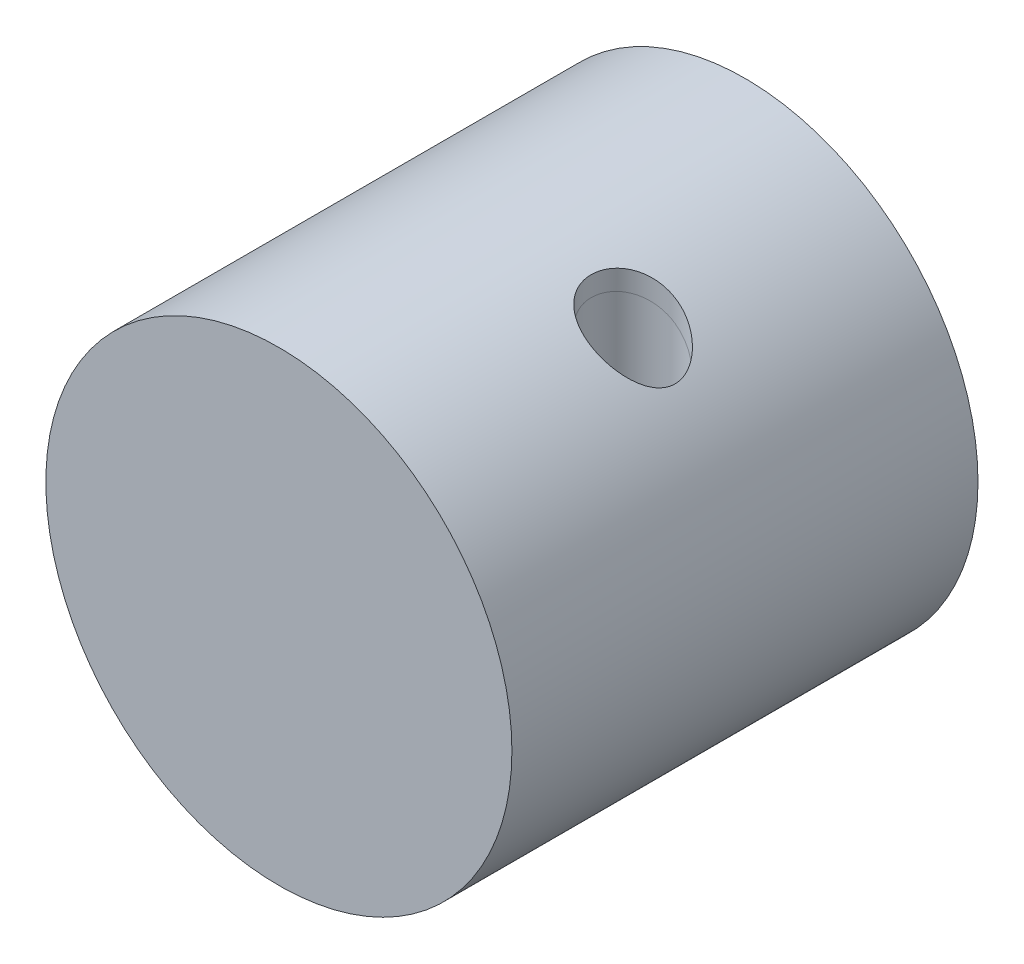
ISO-10303-21;
HEADER;
FILE_DESCRIPTION(('STEP AP214'),'2;1');
FILE_NAME('part.step','',(''),(''),'','','');
FILE_SCHEMA(('AUTOMOTIVE_DESIGN { 1 0 10303 214 1 1 1 1 }'));
ENDSEC;
DATA;
#1=APPLICATION_CONTEXT('core data for automotive mechanical design processes');
#2=APPLICATION_PROTOCOL_DEFINITION('international standard','automotive_design',2000,#1);
#3=PRODUCT_CONTEXT('',#1,'mechanical');
#4=PRODUCT('Part','Part','',(#3));
#5=PRODUCT_RELATED_PRODUCT_CATEGORY('part','',(#4));
#6=PRODUCT_DEFINITION_FORMATION('','',#4);
#7=PRODUCT_DEFINITION_CONTEXT('part definition',#1,'design');
#8=PRODUCT_DEFINITION('design','',#6,#7);
#9=PRODUCT_DEFINITION_SHAPE('','',#8);
#10=(LENGTH_UNIT() NAMED_UNIT(*) SI_UNIT(.MILLI.,.METRE.));
#11=(NAMED_UNIT(*) PLANE_ANGLE_UNIT() SI_UNIT($,.RADIAN.));
#12=(NAMED_UNIT(*) SI_UNIT($,.STERADIAN.) SOLID_ANGLE_UNIT());
#13=UNCERTAINTY_MEASURE_WITH_UNIT(LENGTH_MEASURE(1.E-05),#10,'distance_accuracy_value','');
#14=(GEOMETRIC_REPRESENTATION_CONTEXT(3) GLOBAL_UNCERTAINTY_ASSIGNED_CONTEXT((#13)) GLOBAL_UNIT_ASSIGNED_CONTEXT((#10,
#11,#12)) REPRESENTATION_CONTEXT('',''));
#15=CARTESIAN_POINT('',(0.,0.,0.));
#16=DIRECTION('',(0.,0.,1.));
#17=DIRECTION('',(1.,0.,0.));
#18=AXIS2_PLACEMENT_3D('',#15,#16,#17);
#19=CARTESIAN_POINT('',(13.,50.,0.));
#20=DIRECTION('',(0.,-1.,0.));
#21=DIRECTION('',(0.,0.,-1.));
#22=AXIS2_PLACEMENT_3D('',#19,#20,#21);
#23=CYLINDRICAL_SURFACE('',#22,4.5);
#24=CARTESIAN_POINT('',(13.,21.3541565040626,-4.5));
#25=CARTESIAN_POINT('',(12.8683083991912,21.4343283065168,-4.50000021130359));
#26=CARTESIAN_POINT('',(12.7358798462921,21.5132750834874,-4.49421928114834));
#27=CARTESIAN_POINT('',(12.4703872059696,21.668249916151,-4.47071172861597));
#28=CARTESIAN_POINT('',(12.3373232338289,21.7442784802387,-4.45298719706191));
#29=CARTESIAN_POINT('',(12.0715049528344,21.8929660083225,-4.40523905144603));
#30=CARTESIAN_POINT('',(11.9387506473561,21.9656249357485,-4.37521530393735));
#31=CARTESIAN_POINT('',(11.6747002993951,22.1070983110776,-4.30259453622405));
#32=CARTESIAN_POINT('',(11.5434036630383,22.1759143743938,-4.26000284720951));
#33=CARTESIAN_POINT('',(11.282555931864,22.3097638774261,-4.16172312507943));
#34=CARTESIAN_POINT('',(11.1530225331364,22.3747687408069,-4.10594887628823));
#35=CARTESIAN_POINT('',(10.898039963101,22.5000643262043,-3.98144208737061));
#36=CARTESIAN_POINT('',(10.772588838697,22.5603573224791,-3.91271585406112));
#37=CARTESIAN_POINT('',(10.5271854998054,22.6759070361995,-3.76243096744329));
#38=CARTESIAN_POINT('',(10.4072325009245,22.7311644731645,-3.68087415202204));
#39=CARTESIAN_POINT('',(10.1743410402409,22.8363549959848,-3.50526909122277));
#40=CARTESIAN_POINT('',(10.061401611596,22.8862888164002,-3.41122257322354));
#41=CARTESIAN_POINT('',(9.85624898068404,22.975322232402,-3.22242632233634));
#42=CARTESIAN_POINT('',(9.76313099014731,23.015008903793,-3.1289342918651));
#43=CARTESIAN_POINT('',(9.58469637270071,23.0898886271902,-2.93312799805031));
#44=CARTESIAN_POINT('',(9.49937882892767,23.1250822075068,-2.83081477430216));
#45=CARTESIAN_POINT('',(9.33758184077166,23.1908860186382,-2.61811792437517));
#46=CARTESIAN_POINT('',(9.26109867799038,23.2214981793923,-2.50773772576853));
#47=CARTESIAN_POINT('',(9.11786163311945,23.2781127639742,-2.27972026996115));
#48=CARTESIAN_POINT('',(9.05110710389749,23.3041154944384,-2.16208349619712));
#49=CARTESIAN_POINT('',(8.93364270480029,23.3493817870232,-1.93131481027374));
#50=CARTESIAN_POINT('',(8.88203276550148,23.369039602595,-1.81871716779774));
#51=CARTESIAN_POINT('',(8.78808824093072,23.4045301096044,-1.58908504957571));
#52=CARTESIAN_POINT('',(8.74575668745582,23.4203615509124,-1.47204913819474));
#53=CARTESIAN_POINT('',(8.67086157717957,23.4481930286861,-1.234527664613));
#54=CARTESIAN_POINT('',(8.63829215609193,23.4601953656429,-1.11404422125523));
#55=CARTESIAN_POINT('',(8.5832207458353,23.4804000009878,-0.870436635345307));
#56=CARTESIAN_POINT('',(8.56072239512305,23.4886009260471,-0.74731155523534));
#57=CARTESIAN_POINT('',(8.52674923835205,23.5009544433977,-0.50443262717071));
#58=CARTESIAN_POINT('',(8.51486611245401,23.5052570889302,-0.384743319610918));
#59=CARTESIAN_POINT('',(8.50071891384615,23.5103771853791,-0.144678611979798));
#60=CARTESIAN_POINT('',(8.49845828718292,23.5111933877175,-0.0243029815709277));
#61=CARTESIAN_POINT('',(8.50358686961242,23.5093389423766,0.216158767155219));
#62=CARTESIAN_POINT('',(8.51097157414476,23.5066699223653,0.336244994395977));
#63=CARTESIAN_POINT('',(8.53531527559836,23.4978416125753,0.575358441691054));
#64=CARTESIAN_POINT('',(8.55227779725739,23.4916810378646,0.694385255480596));
#65=CARTESIAN_POINT('',(8.59538623099666,23.4759420493492,0.929237058620315));
#66=CARTESIAN_POINT('',(8.62143399265585,23.4664001480314,1.04508253369694));
#67=CARTESIAN_POINT('',(8.68250580029473,23.4438723692263,1.2740847473049));
#68=CARTESIAN_POINT('',(8.71753309414554,23.4308852455527,1.38724049675405));
#69=CARTESIAN_POINT('',(8.79621011122194,23.4014625394673,1.60999916970905));
#70=CARTESIAN_POINT('',(8.83985639248519,23.3850283334735,1.71960349119148));
#71=CARTESIAN_POINT('',(8.93538222352455,23.3486949522377,1.93461327579998));
#72=CARTESIAN_POINT('',(8.98726483098125,23.3287944899037,2.0400171612902));
#73=CARTESIAN_POINT('',(9.09934969217039,23.2853061167741,2.24697847929423));
#74=CARTESIAN_POINT('',(9.1596326230517,23.2616821154396,2.34848470451322));
#75=CARTESIAN_POINT('',(9.28752698745443,23.2109152115024,2.5458591808504));
#76=CARTESIAN_POINT('',(9.35514107360173,23.1837710344962,2.64172537175548));
#77=CARTESIAN_POINT('',(9.56802289127435,23.0971069586788,2.91991792584962));
#78=CARTESIAN_POINT('',(9.72343676983203,23.0323149530377,3.09303325657342));
#79=CARTESIAN_POINT('',(10.0616383513054,22.8866445481974,3.41655859930834));
#80=CARTESIAN_POINT('',(10.2452219911984,22.8052625896615,3.56590073181515));
#81=CARTESIAN_POINT('',(10.628897624665,22.62898804018,3.83175770188065));
#82=CARTESIAN_POINT('',(10.8289938226726,22.5340920037834,3.94826414525514));
#83=CARTESIAN_POINT('',(11.2547493868579,22.3246703689858,4.1550204413757));
#84=CARTESIAN_POINT('',(11.4812035589697,22.2092102883185,4.24267721453488));
#85=CARTESIAN_POINT('',(11.9392054659052,21.9663988326455,4.37971865178073));
#86=CARTESIAN_POINT('',(12.1707554712021,21.8390420715248,4.42908588560535));
#87=CARTESIAN_POINT('',(12.659974191811,21.5595268572232,4.49467627995439));
#88=CARTESIAN_POINT('',(12.9175736857168,21.4062022741209,4.50641761983514));
#89=CARTESIAN_POINT('',(13.42583718583,21.0911470994441,4.48702827392782));
#90=CARTESIAN_POINT('',(13.6764986798091,20.9294135224704,4.45588226068073));
#91=CARTESIAN_POINT('',(14.1986973118732,20.5793200285554,4.34666011046587));
#92=CARTESIAN_POINT('',(14.4685871607465,20.3902760655443,4.26290182855948));
#93=CARTESIAN_POINT('',(14.9883555997392,20.011314536873,4.04670387964922));
#94=CARTESIAN_POINT('',(15.238200565305,19.821396045987,3.91418441469244));
#95=CARTESIAN_POINT('',(15.6028468958649,19.5340186218994,3.67404780203528));
#96=CARTESIAN_POINT('',(15.7269260715881,19.4341933957403,3.58299117007953));
#97=CARTESIAN_POINT('',(15.9666575586175,19.237718331577,3.38716703808078));
#98=CARTESIAN_POINT('',(16.0823076216437,19.1410693445119,3.28239590067977));
#99=CARTESIAN_POINT('',(16.3037426116431,18.9528114021579,3.05939899752895));
#100=CARTESIAN_POINT('',(16.4095483413621,18.8611919947285,2.94120283253667));
#101=CARTESIAN_POINT('',(16.6101060363578,18.6848121172595,2.69124356588558));
#102=CARTESIAN_POINT('',(16.704866002976,18.6000466961296,2.55949041655201));
#103=CARTESIAN_POINT('',(16.9010293652574,18.422169067047,2.25212480868016));
#104=CARTESIAN_POINT('',(16.999366759505,18.3312746436071,2.07321673609248));
#105=CARTESIAN_POINT('',(17.1730473583596,18.1686721118525,1.69661720206294));
#106=CARTESIAN_POINT('',(17.248429427049,18.0969316010399,1.49895823919562));
#107=CARTESIAN_POINT('',(17.3625845471785,17.9873843483393,1.11857081001964));
#108=CARTESIAN_POINT('',(17.4051334685213,17.9461189053878,0.937989460613869));
#109=CARTESIAN_POINT('',(17.4677343266142,17.8851954952572,0.569398072581713));
#110=CARTESIAN_POINT('',(17.487799970992,17.865524362585,0.381392632752172));
#111=CARTESIAN_POINT('',(17.5039937191368,17.8496597255254,0.00285521143669979));
#112=CARTESIAN_POINT('',(17.5000609774104,17.8535258975482,-0.187681968949652));
#113=CARTESIAN_POINT('',(17.4684233022019,17.8844805824863,-0.564840287927686));
#114=CARTESIAN_POINT('',(17.4407109995213,17.9115762941481,-0.751460194202367));
#115=CARTESIAN_POINT('',(17.3647390349725,17.9852293535269,-1.10974461611815));
#116=CARTESIAN_POINT('',(17.3171766168484,18.0311254040169,-1.28169808785607));
#117=CARTESIAN_POINT('',(17.2041870479813,18.1389651506193,-1.6142234157453));
#118=CARTESIAN_POINT('',(17.1387509861802,18.2009168506225,-1.77478954420719));
#119=CARTESIAN_POINT('',(16.9576613416583,18.3700661725758,-2.15645412234724));
#120=CARTESIAN_POINT('',(16.8329307150907,18.4847637950978,-2.36998357683024));
#121=CARTESIAN_POINT('',(16.6260843851517,18.6703518082029,-2.66762325757396));
#122=CARTESIAN_POINT('',(16.5537209602018,18.7345775071049,-2.76318644343555));
#123=CARTESIAN_POINT('',(16.4029873977113,18.8666907455398,-2.94682308537857));
#124=CARTESIAN_POINT('',(16.3246167199611,18.9345786142348,-3.03489586637039));
#125=CARTESIAN_POINT('',(16.1398355234568,19.0925199508966,-3.22704710887097));
#126=CARTESIAN_POINT('',(16.0317042959621,19.1834712035709,-3.32873135425373));
#127=CARTESIAN_POINT('',(15.8075897598183,19.3685631660196,-3.51981921727333));
#128=CARTESIAN_POINT('',(15.6916046805586,19.4627045925965,-3.60922005182538));
#129=CARTESIAN_POINT('',(15.4525726611511,19.6530239282201,-3.77572676462195));
#130=CARTESIAN_POINT('',(15.3295220442778,19.749202880812,-3.85282616120084));
#131=CARTESIAN_POINT('',(15.0771540043539,19.9425349455287,-3.99454321984657));
#132=CARTESIAN_POINT('',(14.9478361406905,20.0396881257637,-4.05916000273808));
#133=CARTESIAN_POINT('',(14.6745604043106,20.2407506590537,-4.17967131266374));
#134=CARTESIAN_POINT('',(14.5302070680653,20.3446657023553,-4.23466184729926));
#135=CARTESIAN_POINT('',(14.2360779377268,20.5515547461096,-4.32966341927104));
#136=CARTESIAN_POINT('',(14.0863040440678,20.6545290608215,-4.36967965182123));
#137=CARTESIAN_POINT('',(13.7823249350229,20.8585955967925,-4.43419595771555));
#138=CARTESIAN_POINT('',(13.6281224334865,20.9596889106707,-4.45870533016638));
#139=CARTESIAN_POINT('',(13.3163027647315,21.1591661396187,-4.49160533762526));
#140=CARTESIAN_POINT('',(13.1586864054876,21.2575506835336,-4.49999974538235));
#141=CARTESIAN_POINT('',(13.,21.3541565040626,-4.5));
#142=B_SPLINE_CURVE_WITH_KNOTS('',3,(#24,#25,#26,#27,#28,#29,#30,#31,#32,#33,#34,#35,#36,#37,
#38,#39,#40,#41,#42,#43,#44,#45,#46,#47,#48,#49,#50,#51,#52,#53,#54,#55,#56,#57,#58,#59,#60,#61,
#62,#63,#64,#65,#66,#67,#68,#69,#70,#71,#72,#73,#74,#75,#76,#77,#78,#79,#80,#81,#82,#83,#84,#85,
#86,#87,#88,#89,#90,#91,#92,#93,#94,#95,#96,#97,#98,#99,#100,#101,#102,#103,#104,#105,#106,#107,
#108,#109,#110,#111,#112,#113,#114,#115,#116,#117,#118,#119,#120,#121,#122,#123,#124,#125,#126,
#127,#128,#129,#130,#131,#132,#133,#134,#135,#136,#137,#138,#139,#140,#141),.UNSPECIFIED.,.T.,
.F.,(4,2,2,2,2,2,2,2,2,2,2,2,2,2,2,2,2,2,2,2,2,2,2,2,2,2,2,2,2,2,2,2,2,2,2,2,2,2,2,2,2,2,2,2,2,
2,2,2,2,2,2,2,2,2,2,2,2,2,4),(0.,0.462390873566969,0.92470082293051,1.38701578850354,
1.84913492610202,2.3143643609636,2.7793678404161,3.2443047720664,3.70917746780586,
4.12200102006612,4.53477598656816,4.94737657772944,5.35994971085511,5.73571857010017,
6.11161003279503,6.48727523616211,6.86307604980356,7.22370718321317,7.58446745637653,
7.94505930758628,8.30578394697157,8.66272647193885,9.019798284602,9.37672778921269,
9.73379011271338,10.0945542710344,10.4554494027337,11.1765700815364,11.9241849425902,
12.6719907524684,13.4753420946364,14.2790589261662,15.1755167982372,16.0722951374654,
17.0881450086585,18.105664771929,18.6553933789267,19.2052680813512,19.7539530799031,
20.3022381184753,20.9702214564734,21.6370675084439,22.2048036281366,22.7721934212184,
23.3410223707227,23.9100276619139,24.4605356104627,25.0113185220077,25.824285725789,
26.2319890143061,26.6397290091466,27.1612792321153,27.6829474299125,28.2048895949913,
28.7268685081033,29.2847015072763,29.842340790936,30.3996453534189,30.9568194268295),.UNSPECIFIED.);
#143=CARTESIAN_POINT('',(13.,21.3541565040626,-4.5));
#144=VERTEX_POINT('',#143);
#145=EDGE_CURVE('E60',#144,#144,#142,.T.);
#146=ORIENTED_EDGE('',*,*,#145,.T.);
#147=EDGE_LOOP('',(#146));
#148=FACE_BOUND('',#147,.T.);
#149=CARTESIAN_POINT('',(13.,18.9736659610103,-4.5));
#150=CARTESIAN_POINT('',(13.1573048405455,18.865884118898,-4.49999819347798));
#151=CARTESIAN_POINT('',(13.3133336844854,18.7560982025259,-4.49174820899771));
#152=CARTESIAN_POINT('',(13.6216129176258,18.5334264880074,-4.45955755592037));
#153=CARTESIAN_POINT('',(13.7738602678874,18.4205383410653,-4.43560466601998));
#154=CARTESIAN_POINT('',(14.0740930626698,18.1921847978383,-4.37263401970089));
#155=CARTESIAN_POINT('',(14.2220615577849,18.0767117079696,-4.33356336117716));
#156=CARTESIAN_POINT('',(14.5123298905885,17.8445180606472,-4.24099805070468));
#157=CARTESIAN_POINT('',(14.6546309419225,17.7277977771357,-4.18750650616242));
#158=CARTESIAN_POINT('',(14.9333683494292,17.4936487900809,-4.06635691368672));
#159=CARTESIAN_POINT('',(15.069783337296,17.3762190246074,-3.99865175604125));
#160=CARTESIAN_POINT('',(15.3355768795416,17.142095970283,-3.84945638301087));
#161=CARTESIAN_POINT('',(15.4649542067,17.0254028129974,-3.76796377350235));
#162=CARTESIAN_POINT('',(15.7157414213055,16.7941805710272,-3.59141071477895));
#163=CARTESIAN_POINT('',(15.8371631091826,16.6796484692276,-3.49637105659629));
#164=CARTESIAN_POINT('',(16.0713420088373,16.4541303843808,-3.29255870277763));
#165=CARTESIAN_POINT('',(16.1841026784786,16.3431429965742,-3.18379153410061));
#166=CARTESIAN_POINT('',(16.4412038430537,16.0851270054959,-2.9079232775091));
#167=CARTESIAN_POINT('',(16.5811858639302,15.9404973306608,-2.73439563502845));
#168=CARTESIAN_POINT('',(16.8385555377124,15.6683761846916,-2.35946711862697));
#169=CARTESIAN_POINT('',(16.9559807456785,15.5408563358949,-2.15811355070497));
#170=CARTESIAN_POINT('',(17.1361363524372,15.3416467150999,-1.78160387338829));
#171=CARTESIAN_POINT('',(17.2051874410514,15.2639958712455,-1.612721447389));
#172=CARTESIAN_POINT('',(17.2941534563971,15.1629244321608,-1.34866261022265));
#173=CARTESIAN_POINT('',(17.3213761224214,15.131798565177,-1.25884217999105));
#174=CARTESIAN_POINT('',(17.3704920623426,15.0753906760377,-1.0759870363842));
#175=CARTESIAN_POINT('',(17.3923879472733,15.0501057911101,-0.982953923414659));
#176=CARTESIAN_POINT('',(17.430630113263,15.0057990090343,-0.79309605541022));
#177=CARTESIAN_POINT('',(17.4469092010305,14.9868530196642,-0.696239870533675));
#178=CARTESIAN_POINT('',(17.4731589267535,14.9562403737181,-0.500582840894584));
#179=CARTESIAN_POINT('',(17.4831330142065,14.9445697368086,-0.401783090029914));
#180=CARTESIAN_POINT('',(17.4965113212568,14.9289048211127,-0.203186010484013));
#181=CARTESIAN_POINT('',(17.4999192731432,14.9249061814543,-0.103389280948974));
#182=CARTESIAN_POINT('',(17.5000778627942,14.9247202902468,0.0962091914722814));
#183=CARTESIAN_POINT('',(17.4968293217066,14.9285320752003,0.196010932221582));
#184=CARTESIAN_POINT('',(17.4847973339235,14.9426212443483,0.378989003831689));
#185=CARTESIAN_POINT('',(17.4769623964539,14.951790208976,0.462316731834353));
#186=CARTESIAN_POINT('',(17.4567873099648,14.9753401487954,0.627690694007709));
#187=CARTESIAN_POINT('',(17.4444458132953,14.9897226830533,0.709736537179965));
#188=CARTESIAN_POINT('',(17.4009723489507,15.0402183975797,0.953186948072512));
#189=CARTESIAN_POINT('',(17.3633863888133,15.0836856804344,1.1119766259825));
#190=CARTESIAN_POINT('',(17.2576178856304,15.2047044808591,1.47286493044408));
#191=CARTESIAN_POINT('',(17.1833469486477,15.2888468248827,1.67091523146336));
#192=CARTESIAN_POINT('',(17.0129782064279,15.4782028497579,2.04664507762054));
#193=CARTESIAN_POINT('',(16.9168303716112,15.5834647620192,2.22427650371874));
#194=CARTESIAN_POINT('',(16.7370089194579,15.7760787703343,2.51090339430263));
#195=CARTESIAN_POINT('',(16.6576070750602,15.8599680449503,2.62501863573978));
#196=CARTESIAN_POINT('',(16.4909134566999,16.0332222399316,2.84294755027423));
#197=CARTESIAN_POINT('',(16.4036183347836,16.122589478564,2.94675681252815));
#198=CARTESIAN_POINT('',(16.2219832382105,16.3053324716158,3.14433535606263));
#199=CARTESIAN_POINT('',(16.1276383134306,16.3987110227033,3.23809746798502));
#200=CARTESIAN_POINT('',(15.9326623442349,16.5882124733111,3.41568010126314));
#201=CARTESIAN_POINT('',(15.8320320193394,16.6843350580269,3.49950175737821));
#202=CARTESIAN_POINT('',(15.5145883435173,16.9818494428866,3.74156099340461));
#203=CARTESIAN_POINT('',(15.2882492452263,17.1862556176487,3.88390282180519));
#204=CARTESIAN_POINT('',(14.8147698846852,17.5960421699887,4.12641764569267));
#205=CARTESIAN_POINT('',(14.5676234501117,17.8014228194662,4.2265780751561));
#206=CARTESIAN_POINT('',(14.1596881981762,18.1257078519434,4.35091743162239));
#207=CARTESIAN_POINT('',(14.0043024175479,18.2460600058362,4.38944712627148));
#208=CARTESIAN_POINT('',(13.6883601167547,18.4842604629528,4.44994728424654));
#209=CARTESIAN_POINT('',(13.5278026150909,18.602108283772,4.47191458479224));
#210=CARTESIAN_POINT('',(13.202830733045,18.8341474158214,4.49837944182088));
#211=CARTESIAN_POINT('',(13.0384194255337,18.9483414793629,4.50289047045559));
#212=CARTESIAN_POINT('',(12.7070394027941,19.1721431679979,4.49350929869456));
#213=CARTESIAN_POINT('',(12.5400716035533,19.2817523856282,4.47962354407075));
#214=CARTESIAN_POINT('',(12.2461383199308,19.4693265247899,4.43824664004647));
#215=CARTESIAN_POINT('',(12.1193445849289,19.5484913204745,4.41489783753284));
#216=CARTESIAN_POINT('',(11.8661791811507,19.7031920787674,4.35675454422175));
#217=CARTESIAN_POINT('',(11.7398074286871,19.7787288062329,4.3219624780997));
#218=CARTESIAN_POINT('',(11.4885094535112,19.9257456874706,4.24061731417767));
#219=CARTESIAN_POINT('',(11.3635830266592,19.9972264198259,4.1940658990266));
#220=CARTESIAN_POINT('',(11.1163704178351,20.1356988802355,4.08900552733807));
#221=CARTESIAN_POINT('',(10.9940829574998,20.202692816435,4.03050251097779));
#222=CARTESIAN_POINT('',(10.7524624446542,20.3323261684733,3.9009617284414));
#223=CARTESIAN_POINT('',(10.6331581015446,20.3949295236658,3.82983404092121));
#224=CARTESIAN_POINT('',(10.3999156612217,20.5148469129522,3.67547366505481));
#225=CARTESIAN_POINT('',(10.2859750280482,20.5721634591994,3.59224677487138));
#226=CARTESIAN_POINT('',(10.0648825160021,20.6812315189219,3.41397827952344));
#227=CARTESIAN_POINT('',(9.95772981937107,20.7329837032748,3.3189381016353));
#228=CARTESIAN_POINT('',(9.75169948837346,20.8306830787249,3.11757651173706));
#229=CARTESIAN_POINT('',(9.65282063622534,20.8766311246104,3.0112567651472));
#230=CARTESIAN_POINT('',(9.47616892723456,20.9573492279439,2.80161903044677));
#231=CARTESIAN_POINT('',(9.3972896815151,20.992799091118,2.69949244895197));
#232=CARTESIAN_POINT('',(9.24798977699736,21.0589969932309,2.48780798170007));
#233=CARTESIAN_POINT('',(9.17756813933877,21.0897455763957,2.37825095822289));
#234=CARTESIAN_POINT('',(9.04607141481435,21.1464824914329,2.15255672010699));
#235=CARTESIAN_POINT('',(8.98499249388752,21.1724727768808,2.0364222316823));
#236=CARTESIAN_POINT('',(8.87291418628569,21.2196865099992,1.7984593012488));
#237=CARTESIAN_POINT('',(8.82191422208637,21.2409102308034,1.67663118597977));
#238=CARTESIAN_POINT('',(8.73451029698574,21.2769915952388,1.43883956226907));
#239=CARTESIAN_POINT('',(8.69723576753379,21.2922362616647,1.32325373790628));
#240=CARTESIAN_POINT('',(8.63205833433572,21.3187431442887,1.08897743435534));
#241=CARTESIAN_POINT('',(8.60415848823361,21.3300040612112,0.970285955806803));
#242=CARTESIAN_POINT('',(8.55806419689971,21.3485398766274,0.730799620203157));
#243=CARTESIAN_POINT('',(8.53986409017319,21.3558171003706,0.610006032709893));
#244=CARTESIAN_POINT('',(8.51333631213953,21.3664061100691,0.36712085779697));
#245=CARTESIAN_POINT('',(8.50501222886543,21.3697164548321,0.245028814882585));
#246=CARTESIAN_POINT('',(8.498450636444,21.3723266725369,0.00464375870445027));
#247=CARTESIAN_POINT('',(8.49988343472827,21.3717576321441,-0.113638981070822));
#248=CARTESIAN_POINT('',(8.51205091744793,21.3669144295798,-0.349692338573096));
#249=CARTESIAN_POINT('',(8.52278893416649,21.3626389400951,-0.467462757647346));
#250=CARTESIAN_POINT('',(8.55345576798954,21.3503785955105,-0.701550239195272));
#251=CARTESIAN_POINT('',(8.57338043006635,21.3423954173492,-0.817867934319052));
#252=CARTESIAN_POINT('',(8.62222673148906,21.3227085242443,-1.04832250295639));
#253=CARTESIAN_POINT('',(8.65115169504123,21.3110034346005,-1.16245855413359));
#254=CARTESIAN_POINT('',(8.71758328095727,21.2839146350741,-1.3872991335741));
#255=CARTESIAN_POINT('',(8.75505835272164,21.2685444405412,-1.49801461964574));
#256=CARTESIAN_POINT('',(8.83828933781909,21.2340921487451,-1.71573660747693));
#257=CARTESIAN_POINT('',(8.88404824100897,21.2150087110863,-1.82274175340548));
#258=CARTESIAN_POINT('',(8.98336786517539,21.173143428412,-2.03226527800021));
#259=CARTESIAN_POINT('',(9.03692579721937,21.1503629051422,-2.13478524359522));
#260=CARTESIAN_POINT('',(9.15135189893467,21.1011051693443,-2.33477789515773));
#261=CARTESIAN_POINT('',(9.21222279409749,21.0746265779703,-2.43224867983972));
#262=CARTESIAN_POINT('',(9.34206605467198,21.0173960307142,-2.62357877392254));
#263=CARTESIAN_POINT('',(9.41118462305793,20.9865643463664,-2.71731515444535));
#264=CARTESIAN_POINT('',(9.55575742702039,20.9211331480284,-2.89838568241364));
#265=CARTESIAN_POINT('',(9.63121395511037,20.8865322693216,-2.98571749167085));
#266=CARTESIAN_POINT('',(9.86598346658096,20.7772004584702,-3.23735095187829));
#267=CARTESIAN_POINT('',(10.0338198629333,20.6968868220278,-3.39147061682926));
#268=CARTESIAN_POINT('',(10.3959624905871,20.5174809547294,-3.67767681090386));
#269=CARTESIAN_POINT('',(10.591228090755,20.4175846326949,-3.80802858475063));
#270=CARTESIAN_POINT('',(10.9936395722533,20.2037581319893,-4.03458618975315));
#271=CARTESIAN_POINT('',(11.2007947989718,20.089816830784,-4.13076472130205));
#272=CARTESIAN_POINT('',(11.6428163613013,19.8372424513343,-4.29762595419243));
#273=CARTESIAN_POINT('',(11.8783129311139,19.6972731648056,-4.36458415363147));
#274=CARTESIAN_POINT('',(12.3493260466205,19.4054314703116,-4.45917561803221));
#275=CARTESIAN_POINT('',(12.5848421329947,19.253575445725,-4.48686203789209));
#276=CARTESIAN_POINT('',(12.8786634361149,19.0563763210443,-4.49877834819643));
#277=CARTESIAN_POINT('',(12.9394263206978,19.0151697234887,-4.50000069564093));
#278=CARTESIAN_POINT('',(13.,18.9736659610103,-4.5));
#279=B_SPLINE_CURVE_WITH_KNOTS('',3,(#149,#150,#151,#152,#153,#154,#155,#156,#157,#158,#159,
#160,#161,#162,#163,#164,#165,#166,#167,#168,#169,#170,#171,#172,#173,#174,#175,#176,#177,#178,
#179,#180,#181,#182,#183,#184,#185,#186,#187,#188,#189,#190,#191,#192,#193,#194,#195,#196,#197,
#198,#199,#200,#201,#202,#203,#204,#205,#206,#207,#208,#209,#210,#211,#212,#213,#214,#215,#216,
#217,#218,#219,#220,#221,#222,#223,#224,#225,#226,#227,#228,#229,#230,#231,#232,#233,#234,#235,
#236,#237,#238,#239,#240,#241,#242,#243,#244,#245,#246,#247,#248,#249,#250,#251,#252,#253,#254,
#255,#256,#257,#258,#259,#260,#261,#262,#263,#264,#265,#266,#267,#268,#269,#270,#271,#272,#273,
#274,#275,#276,#277,#278),.UNSPECIFIED.,.T.,.F.,(4,2,2,2,2,2,2,2,2,2,2,2,2,2,2,2,2,2,2,2,2,2,2,
2,2,2,2,2,2,2,2,2,2,2,2,2,2,2,2,2,2,2,2,2,2,2,2,2,2,2,2,2,2,2,2,2,2,2,2,2,2,2,2,2,4),(0.,
0.572028592503739,1.14450291447576,1.71899890096846,2.29337119411409,2.86967812731664,
3.4460852363044,4.02161705613829,4.59691789064213,5.39164036963954,6.18502801633746,
6.77755028593112,7.07388376536903,7.37007169673274,7.66968912829924,7.96914249545728,
8.26842559858473,8.56767178424123,8.81996116556383,9.07232605383733,9.57684052943903,
10.2560953829469,10.9369194995301,11.4234304790432,11.9101487901819,12.397212128642,
12.8842198124318,13.8902463684304,14.8965724125065,15.4967581026012,16.0970583760701,
16.696895265876,17.2965220434354,17.7499596935243,18.2033013280329,18.6565781304548,
19.1096301912517,19.5660491204063,20.0222500417575,20.4783958985867,20.9344744992929,
21.3354079011845,21.7362948553369,22.1370168496862,22.5377158759994,22.9044645654359,
23.2713327576698,23.6379865829706,24.0047735755918,24.3592295477969,24.7138125063826,
25.0682352477317,25.4227890486455,25.7760550918765,26.1294488934229,26.4827166302872,
26.8361164384626,27.1971245878693,27.5582638851223,28.2798760521671,29.042220785755,
29.8051731633492,30.6480195402715,31.4897240207922,31.7099961776683),.UNSPECIFIED.);
#280=CARTESIAN_POINT('',(13.,18.9736659610103,-4.5));
#281=VERTEX_POINT('',#280);
#282=EDGE_CURVE('E10',#281,#281,#279,.T.);
#283=ORIENTED_EDGE('',*,*,#282,.T.);
#284=EDGE_LOOP('',(#283));
#285=FACE_BOUND('',#284,.T.);
#286=ADVANCED_FACE('F39',(#148,#285),#23,.F.);
#287=CARTESIAN_POINT('',(0.,0.,25.));
#288=DIRECTION('',(0.,0.,-1.));
#289=DIRECTION('',(-1.,0.,0.));
#290=AXIS2_PLACEMENT_3D('',#287,#288,#289);
#291=CYLINDRICAL_SURFACE('',#290,25.);
#292=CARTESIAN_POINT('',(0.,0.,-25.));
#293=DIRECTION('',(0.,0.,1.));
#294=DIRECTION('',(1.,0.,0.));
#295=AXIS2_PLACEMENT_3D('',#292,#293,#294);
#296=CIRCLE('',#295,25.);
#297=CARTESIAN_POINT('',(25.,0.,-25.));
#298=VERTEX_POINT('',#297);
#299=EDGE_CURVE('E55',#298,#298,#296,.T.);
#300=ORIENTED_EDGE('',*,*,#299,.T.);
#301=EDGE_LOOP('',(#300));
#302=FACE_BOUND('',#301,.T.);
#303=CARTESIAN_POINT('',(0.,0.,25.));
#304=DIRECTION('',(0.,0.,1.));
#305=DIRECTION('',(1.,0.,0.));
#306=AXIS2_PLACEMENT_3D('',#303,#304,#305);
#307=CIRCLE('',#306,25.);
#308=CARTESIAN_POINT('',(25.,0.,25.));
#309=VERTEX_POINT('',#308);
#310=EDGE_CURVE('E49',#309,#309,#307,.T.);
#311=ORIENTED_EDGE('',*,*,#310,.F.);
#312=EDGE_LOOP('',(#311));
#313=FACE_BOUND('',#312,.T.);
#314=ORIENTED_EDGE('',*,*,#145,.F.);
#315=EDGE_LOOP('',(#314));
#316=FACE_BOUND('',#315,.T.);
#317=ADVANCED_FACE('F68',(#302,#313,#316),#291,.T.);
#318=CARTESIAN_POINT('',(0.,0.,25.));
#319=DIRECTION('',(0.,0.,1.));
#320=DIRECTION('',(1.,0.,0.));
#321=AXIS2_PLACEMENT_3D('',#318,#319,#320);
#322=PLANE('',#321);
#323=ORIENTED_EDGE('',*,*,#310,.T.);
#324=EDGE_LOOP('',(#323));
#325=FACE_BOUND('',#324,.T.);
#326=ADVANCED_FACE('F84',(#325),#322,.T.);
#327=CARTESIAN_POINT('',(0.,0.,-25.));
#328=DIRECTION('',(0.,0.,1.));
#329=DIRECTION('',(1.,0.,0.));
#330=AXIS2_PLACEMENT_3D('',#327,#328,#329);
#331=PLANE('',#330);
#332=ORIENTED_EDGE('',*,*,#299,.F.);
#333=EDGE_LOOP('',(#332));
#334=FACE_BOUND('',#333,.T.);
#335=ADVANCED_FACE('F75',(#334),#331,.F.);
#336=ORIENTED_EDGE('',*,*,#282,.F.);
#337=EDGE_LOOP('',(#336));
#338=FACE_BOUND('',#337,.T.);
#339=CARTESIAN_POINT('',(13.,0.,0.));
#340=DIRECTION('',(0.,1.,0.));
#341=DIRECTION('',(0.,0.,1.));
#342=AXIS2_PLACEMENT_3D('',#339,#340,#341);
#343=CIRCLE('',#342,4.5);
#344=CARTESIAN_POINT('',(13.,0.,4.5));
#345=VERTEX_POINT('',#344);
#346=EDGE_CURVE('E63',#345,#345,#343,.T.);
#347=ORIENTED_EDGE('',*,*,#346,.F.);
#348=EDGE_LOOP('',(#347));
#349=FACE_BOUND('',#348,.T.);
#350=ADVANCED_FACE('F71',(#338,#349),#23,.F.);
#351=CARTESIAN_POINT('',(13.,0.,0.));
#352=DIRECTION('',(0.,1.,0.));
#353=DIRECTION('',(0.,0.,1.));
#354=AXIS2_PLACEMENT_3D('',#351,#352,#353);
#355=PLANE('',#354);
#356=ORIENTED_EDGE('',*,*,#346,.T.);
#357=EDGE_LOOP('',(#356));
#358=FACE_BOUND('',#357,.T.);
#359=ADVANCED_FACE('F74',(#358),#355,.T.);
#360=CLOSED_SHELL('',(#286,#317,#326,#335,#350,#359));
#361=MANIFOLD_SOLID_BREP('B2',#360);
#362=ADVANCED_BREP_SHAPE_REPRESENTATION('',(#18,#361),#14);
#363=SHAPE_DEFINITION_REPRESENTATION(#9,#362);
ENDSEC;
END-ISO-10303-21;
